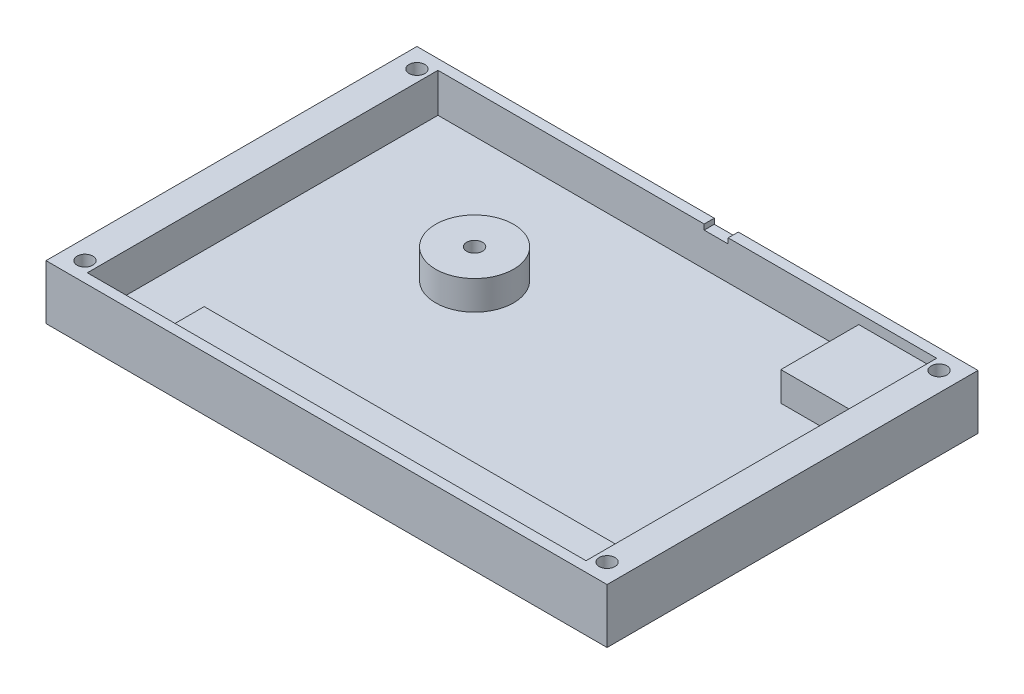
ISO-10303-21;
HEADER;
FILE_DESCRIPTION(('STEP AP214'),'2;1');
FILE_NAME('part.step','',(''),(''),'','','');
FILE_SCHEMA(('AUTOMOTIVE_DESIGN { 1 0 10303 214 1 1 1 1 }'));
ENDSEC;
DATA;
#1=APPLICATION_CONTEXT('core data for automotive mechanical design processes');
#2=APPLICATION_PROTOCOL_DEFINITION('international standard','automotive_design',2000,#1);
#3=PRODUCT_CONTEXT('',#1,'mechanical');
#4=PRODUCT('Part','Part','',(#3));
#5=PRODUCT_RELATED_PRODUCT_CATEGORY('part','',(#4));
#6=PRODUCT_DEFINITION_FORMATION('','',#4);
#7=PRODUCT_DEFINITION_CONTEXT('part definition',#1,'design');
#8=PRODUCT_DEFINITION('design','',#6,#7);
#9=PRODUCT_DEFINITION_SHAPE('','',#8);
#10=(LENGTH_UNIT() NAMED_UNIT(*) SI_UNIT(.MILLI.,.METRE.));
#11=(NAMED_UNIT(*) PLANE_ANGLE_UNIT() SI_UNIT($,.RADIAN.));
#12=(NAMED_UNIT(*) SI_UNIT($,.STERADIAN.) SOLID_ANGLE_UNIT());
#13=UNCERTAINTY_MEASURE_WITH_UNIT(LENGTH_MEASURE(1.E-05),#10,'distance_accuracy_value','');
#14=(GEOMETRIC_REPRESENTATION_CONTEXT(3) GLOBAL_UNCERTAINTY_ASSIGNED_CONTEXT((#13)) GLOBAL_UNIT_ASSIGNED_CONTEXT((#10,
#11,#12)) REPRESENTATION_CONTEXT('',''));
#15=CARTESIAN_POINT('',(0.,0.,0.));
#16=DIRECTION('',(0.,0.,1.));
#17=DIRECTION('',(1.,0.,0.));
#18=AXIS2_PLACEMENT_3D('',#15,#16,#17);
#19=CARTESIAN_POINT('',(0.,7.2898,0.));
#20=DIRECTION('',(0.,-1.,0.));
#21=DIRECTION('',(0.,0.,-1.));
#22=AXIS2_PLACEMENT_3D('',#19,#20,#21);
#23=PLANE('',#22);
#24=DIRECTION('',(1.,0.,0.));
#25=VECTOR('',#24,1.);
#26=CARTESIAN_POINT('',(0.,7.2898,22.225));
#27=LINE('',#26,#25);
#28=CARTESIAN_POINT('',(-27.94,7.2898,22.225));
#29=VERTEX_POINT('',#28);
#30=CARTESIAN_POINT('',(40.64,7.2898,22.225));
#31=VERTEX_POINT('',#30);
#32=EDGE_CURVE('E289',#29,#31,#27,.T.);
#33=ORIENTED_EDGE('',*,*,#32,.F.);
#34=DIRECTION('',(0.,0.,1.));
#35=VECTOR('',#34,1.);
#36=CARTESIAN_POINT('',(-27.94,7.2898,0.));
#37=LINE('',#36,#35);
#38=CARTESIAN_POINT('',(-27.94,7.2898,28.575));
#39=VERTEX_POINT('',#38);
#40=EDGE_CURVE('E281',#29,#39,#37,.T.);
#41=ORIENTED_EDGE('',*,*,#40,.T.);
#42=DIRECTION('',(1.,0.,0.));
#43=VECTOR('',#42,1.);
#44=CARTESIAN_POINT('',(40.64,7.2898,28.575));
#45=LINE('',#44,#43);
#46=CARTESIAN_POINT('',(40.64,7.2898,28.575));
#47=VERTEX_POINT('',#46);
#48=EDGE_CURVE('E321',#39,#47,#45,.T.);
#49=ORIENTED_EDGE('',*,*,#48,.T.);
#50=DIRECTION('',(0.,0.,-1.));
#51=VECTOR('',#50,1.);
#52=CARTESIAN_POINT('',(40.64,7.2898,-28.575));
#53=LINE('',#52,#51);
#54=EDGE_CURVE('E325',#47,#31,#53,.T.);
#55=ORIENTED_EDGE('',*,*,#54,.T.);
#56=EDGE_LOOP('',(#33,#41,#49,#55));
#57=FACE_BOUND('',#56,.T.);
#58=ADVANCED_FACE('F62',(#57),#23,.F.);
#59=CARTESIAN_POINT('',(-45.72,8.89,-30.226));
#60=DIRECTION('',(1.,0.,0.));
#61=DIRECTION('',(0.,0.,-1.));
#62=AXIS2_PLACEMENT_3D('',#59,#60,#61);
#63=PLANE('',#62);
#64=DIRECTION('',(0.,0.,1.));
#65=VECTOR('',#64,1.);
#66=CARTESIAN_POINT('',(-45.72,0.,-30.226));
#67=LINE('',#66,#65);
#68=CARTESIAN_POINT('',(-45.72,0.,-30.226));
#69=VERTEX_POINT('',#68);
#70=CARTESIAN_POINT('',(-45.72,0.,30.226));
#71=VERTEX_POINT('',#70);
#72=EDGE_CURVE('E347',#69,#71,#67,.T.);
#73=ORIENTED_EDGE('',*,*,#72,.T.);
#74=DIRECTION('',(0.,-1.,0.));
#75=VECTOR('',#74,1.);
#76=CARTESIAN_POINT('',(-45.72,8.89,30.226));
#77=LINE('',#76,#75);
#78=CARTESIAN_POINT('',(-45.72,8.89,30.226));
#79=VERTEX_POINT('',#78);
#80=EDGE_CURVE('E13',#79,#71,#77,.T.);
#81=ORIENTED_EDGE('',*,*,#80,.F.);
#82=DIRECTION('',(0.,0.,1.));
#83=VECTOR('',#82,1.);
#84=CARTESIAN_POINT('',(-45.72,8.89,-30.226));
#85=LINE('',#84,#83);
#86=CARTESIAN_POINT('',(-45.72,8.89,-30.226));
#87=VERTEX_POINT('',#86);
#88=EDGE_CURVE('E354',#87,#79,#85,.T.);
#89=ORIENTED_EDGE('',*,*,#88,.F.);
#90=DIRECTION('',(0.,-1.,0.));
#91=VECTOR('',#90,1.);
#92=CARTESIAN_POINT('',(-45.72,8.89,-30.226));
#93=LINE('',#92,#91);
#94=EDGE_CURVE('E366',#87,#69,#93,.T.);
#95=ORIENTED_EDGE('',*,*,#94,.T.);
#96=EDGE_LOOP('',(#73,#81,#89,#95));
#97=FACE_BOUND('',#96,.T.);
#98=ADVANCED_FACE('F64',(#97),#63,.F.);
#99=CARTESIAN_POINT('',(45.72,8.89,30.226));
#100=DIRECTION('',(0.,0.,-1.));
#101=DIRECTION('',(-1.,0.,0.));
#102=AXIS2_PLACEMENT_3D('',#99,#100,#101);
#103=PLANE('',#102);
#104=DIRECTION('',(1.,0.,0.));
#105=VECTOR('',#104,1.);
#106=CARTESIAN_POINT('',(45.72,0.,30.226));
#107=LINE('',#106,#105);
#108=CARTESIAN_POINT('',(45.72,0.,30.226));
#109=VERTEX_POINT('',#108);
#110=EDGE_CURVE('E369',#71,#109,#107,.T.);
#111=ORIENTED_EDGE('',*,*,#110,.T.);
#112=DIRECTION('',(0.,-1.,0.));
#113=VECTOR('',#112,1.);
#114=CARTESIAN_POINT('',(45.72,8.89,30.226));
#115=LINE('',#114,#113);
#116=CARTESIAN_POINT('',(45.72,8.89,30.226));
#117=VERTEX_POINT('',#116);
#118=EDGE_CURVE('E72',#117,#109,#115,.T.);
#119=ORIENTED_EDGE('',*,*,#118,.F.);
#120=DIRECTION('',(1.,0.,0.));
#121=VECTOR('',#120,1.);
#122=CARTESIAN_POINT('',(45.72,8.89,30.226));
#123=LINE('',#122,#121);
#124=EDGE_CURVE('E357',#79,#117,#123,.T.);
#125=ORIENTED_EDGE('',*,*,#124,.F.);
#126=ORIENTED_EDGE('',*,*,#80,.T.);
#127=EDGE_LOOP('',(#111,#119,#125,#126));
#128=FACE_BOUND('',#127,.T.);
#129=ADVANCED_FACE('F462',(#128),#103,.F.);
#130=CARTESIAN_POINT('',(45.72,8.89,-30.226));
#131=DIRECTION('',(-1.,0.,0.));
#132=DIRECTION('',(0.,0.,1.));
#133=AXIS2_PLACEMENT_3D('',#130,#131,#132);
#134=PLANE('',#133);
#135=DIRECTION('',(0.,0.,-1.));
#136=VECTOR('',#135,1.);
#137=CARTESIAN_POINT('',(45.72,0.,-30.226));
#138=LINE('',#137,#136);
#139=CARTESIAN_POINT('',(45.72,0.,-30.226));
#140=VERTEX_POINT('',#139);
#141=EDGE_CURVE('E371',#109,#140,#138,.T.);
#142=ORIENTED_EDGE('',*,*,#141,.T.);
#143=DIRECTION('',(0.,-1.,0.));
#144=VECTOR('',#143,1.);
#145=CARTESIAN_POINT('',(45.72,8.89,-30.226));
#146=LINE('',#145,#144);
#147=CARTESIAN_POINT('',(45.72,8.89,-30.226));
#148=VERTEX_POINT('',#147);
#149=EDGE_CURVE('E376',#148,#140,#146,.T.);
#150=ORIENTED_EDGE('',*,*,#149,.F.);
#151=DIRECTION('',(0.,0.,-1.));
#152=VECTOR('',#151,1.);
#153=CARTESIAN_POINT('',(45.72,8.89,-30.226));
#154=LINE('',#153,#152);
#155=EDGE_CURVE('E360',#117,#148,#154,.T.);
#156=ORIENTED_EDGE('',*,*,#155,.F.);
#157=ORIENTED_EDGE('',*,*,#118,.T.);
#158=EDGE_LOOP('',(#142,#150,#156,#157));
#159=FACE_BOUND('',#158,.T.);
#160=ADVANCED_FACE('F383',(#159),#134,.F.);
#161=CARTESIAN_POINT('',(45.72,8.89,-30.226));
#162=DIRECTION('',(0.,0.,1.));
#163=DIRECTION('',(1.,0.,0.));
#164=AXIS2_PLACEMENT_3D('',#161,#162,#163);
#165=PLANE('',#164);
#166=DIRECTION('',(-1.,0.,0.));
#167=VECTOR('',#166,1.);
#168=CARTESIAN_POINT('',(2.74320000000001,8.0264,-30.226));
#169=LINE('',#168,#167);
#170=CARTESIAN_POINT('',(6.65480000000001,8.0264,-30.226));
#171=VERTEX_POINT('',#170);
#172=CARTESIAN_POINT('',(2.74320000000001,8.0264,-30.226));
#173=VERTEX_POINT('',#172);
#174=EDGE_CURVE('E215',#171,#173,#169,.T.);
#175=ORIENTED_EDGE('',*,*,#174,.F.);
#176=DIRECTION('',(0.,-1.,0.));
#177=VECTOR('',#176,1.);
#178=CARTESIAN_POINT('',(6.65480000000001,8.0264,-30.226));
#179=LINE('',#178,#177);
#180=CARTESIAN_POINT('',(6.65480000000001,8.89,-30.226));
#181=VERTEX_POINT('',#180);
#182=EDGE_CURVE('E196',#181,#171,#179,.T.);
#183=ORIENTED_EDGE('',*,*,#182,.F.);
#184=DIRECTION('',(-1.,0.,0.));
#185=VECTOR('',#184,1.);
#186=CARTESIAN_POINT('',(45.72,8.89,-30.226));
#187=LINE('',#186,#185);
#188=EDGE_CURVE('E363',#148,#181,#187,.T.);
#189=ORIENTED_EDGE('',*,*,#188,.F.);
#190=ORIENTED_EDGE('',*,*,#149,.T.);
#191=DIRECTION('',(-1.,0.,0.));
#192=VECTOR('',#191,1.);
#193=CARTESIAN_POINT('',(45.72,0.,-30.226));
#194=LINE('',#193,#192);
#195=EDGE_CURVE('E358',#140,#69,#194,.T.);
#196=ORIENTED_EDGE('',*,*,#195,.T.);
#197=ORIENTED_EDGE('',*,*,#94,.F.);
#198=CARTESIAN_POINT('',(2.74320000000001,8.89,-30.226));
#199=VERTEX_POINT('',#198);
#200=EDGE_CURVE('E362',#199,#87,#187,.T.);
#201=ORIENTED_EDGE('',*,*,#200,.F.);
#202=DIRECTION('',(0.,1.,0.));
#203=VECTOR('',#202,1.);
#204=CARTESIAN_POINT('',(2.74320000000001,8.0264,-30.226));
#205=LINE('',#204,#203);
#206=EDGE_CURVE('E201',#173,#199,#205,.T.);
#207=ORIENTED_EDGE('',*,*,#206,.F.);
#208=EDGE_LOOP('',(#175,#183,#189,#190,#196,#197,#201,#207));
#209=FACE_BOUND('',#208,.T.);
#210=ADVANCED_FACE('F392',(#209),#165,.F.);
#211=CARTESIAN_POINT('',(0.,8.89,0.));
#212=DIRECTION('',(0.,-1.,0.));
#213=DIRECTION('',(0.,0.,-1.));
#214=AXIS2_PLACEMENT_3D('',#211,#212,#213);
#215=PLANE('',#214);
#216=CARTESIAN_POINT('',(42.545,8.89,-27.051));
#217=DIRECTION('',(0.,1.,0.));
#218=DIRECTION('',(0.,0.,1.));
#219=AXIS2_PLACEMENT_3D('',#216,#217,#218);
#220=CIRCLE('',#219,1.28905);
#221=CARTESIAN_POINT('',(42.545,8.89,-25.76195));
#222=VERTEX_POINT('',#221);
#223=EDGE_CURVE('E207',#222,#222,#220,.T.);
#224=ORIENTED_EDGE('',*,*,#223,.F.);
#225=EDGE_LOOP('',(#224));
#226=FACE_BOUND('',#225,.T.);
#227=CARTESIAN_POINT('',(42.545,8.89,27.051));
#228=DIRECTION('',(0.,1.,0.));
#229=DIRECTION('',(0.,0.,1.));
#230=AXIS2_PLACEMENT_3D('',#227,#228,#229);
#231=CIRCLE('',#230,1.28905);
#232=CARTESIAN_POINT('',(42.545,8.89,28.34005));
#233=VERTEX_POINT('',#232);
#234=EDGE_CURVE('E229',#233,#233,#231,.T.);
#235=ORIENTED_EDGE('',*,*,#234,.F.);
#236=EDGE_LOOP('',(#235));
#237=FACE_BOUND('',#236,.T.);
#238=CARTESIAN_POINT('',(-42.545,8.89,27.051));
#239=DIRECTION('',(0.,1.,0.));
#240=DIRECTION('',(0.,0.,1.));
#241=AXIS2_PLACEMENT_3D('',#238,#239,#240);
#242=CIRCLE('',#241,1.28905);
#243=CARTESIAN_POINT('',(-42.545,8.89,28.34005));
#244=VERTEX_POINT('',#243);
#245=EDGE_CURVE('E235',#244,#244,#242,.T.);
#246=ORIENTED_EDGE('',*,*,#245,.F.);
#247=EDGE_LOOP('',(#246));
#248=FACE_BOUND('',#247,.T.);
#249=CARTESIAN_POINT('',(-42.545,8.89,-27.051));
#250=DIRECTION('',(0.,1.,0.));
#251=DIRECTION('',(0.,0.,1.));
#252=AXIS2_PLACEMENT_3D('',#249,#250,#251);
#253=CIRCLE('',#252,1.28905);
#254=CARTESIAN_POINT('',(-42.545,8.89,-25.76195));
#255=VERTEX_POINT('',#254);
#256=EDGE_CURVE('E241',#255,#255,#253,.T.);
#257=ORIENTED_EDGE('',*,*,#256,.F.);
#258=EDGE_LOOP('',(#257));
#259=FACE_BOUND('',#258,.T.);
#260=ORIENTED_EDGE('',*,*,#188,.T.);
#261=DIRECTION('',(0.,0.,-1.));
#262=VECTOR('',#261,1.);
#263=CARTESIAN_POINT('',(6.65480000000002,8.89,30.227));
#264=LINE('',#263,#262);
#265=CARTESIAN_POINT('',(6.65480000000001,8.89,-28.575));
#266=VERTEX_POINT('',#265);
#267=EDGE_CURVE('E208',#266,#181,#264,.T.);
#268=ORIENTED_EDGE('',*,*,#267,.F.);
#269=DIRECTION('',(-1.,0.,0.));
#270=VECTOR('',#269,1.);
#271=CARTESIAN_POINT('',(40.64,8.89,-28.575));
#272=LINE('',#271,#270);
#273=CARTESIAN_POINT('',(40.64,8.89,-28.575));
#274=VERTEX_POINT('',#273);
#275=EDGE_CURVE('E213',#274,#266,#272,.T.);
#276=ORIENTED_EDGE('',*,*,#275,.F.);
#277=DIRECTION('',(0.,0.,-1.));
#278=VECTOR('',#277,1.);
#279=CARTESIAN_POINT('',(40.64,8.89,-28.575));
#280=LINE('',#279,#278);
#281=CARTESIAN_POINT('',(40.64,8.89,28.575));
#282=VERTEX_POINT('',#281);
#283=EDGE_CURVE('E339',#282,#274,#280,.T.);
#284=ORIENTED_EDGE('',*,*,#283,.F.);
#285=DIRECTION('',(1.,0.,0.));
#286=VECTOR('',#285,1.);
#287=CARTESIAN_POINT('',(40.64,8.89,28.575));
#288=LINE('',#287,#286);
#289=CARTESIAN_POINT('',(-40.64,8.89,28.575));
#290=VERTEX_POINT('',#289);
#291=EDGE_CURVE('E336',#290,#282,#288,.T.);
#292=ORIENTED_EDGE('',*,*,#291,.F.);
#293=DIRECTION('',(0.,0.,1.));
#294=VECTOR('',#293,1.);
#295=CARTESIAN_POINT('',(-40.64,8.89,-28.575));
#296=LINE('',#295,#294);
#297=CARTESIAN_POINT('',(-40.64,8.89,-28.575));
#298=VERTEX_POINT('',#297);
#299=EDGE_CURVE('E277',#298,#290,#296,.T.);
#300=ORIENTED_EDGE('',*,*,#299,.F.);
#301=CARTESIAN_POINT('',(2.74320000000001,8.89,-28.575));
#302=VERTEX_POINT('',#301);
#303=EDGE_CURVE('E342',#302,#298,#272,.T.);
#304=ORIENTED_EDGE('',*,*,#303,.F.);
#305=DIRECTION('',(0.,0.,-1.));
#306=VECTOR('',#305,1.);
#307=CARTESIAN_POINT('',(2.74320000000002,8.89,30.227));
#308=LINE('',#307,#306);
#309=EDGE_CURVE('E222',#302,#199,#308,.T.);
#310=ORIENTED_EDGE('',*,*,#309,.T.);
#311=ORIENTED_EDGE('',*,*,#200,.T.);
#312=ORIENTED_EDGE('',*,*,#88,.T.);
#313=ORIENTED_EDGE('',*,*,#124,.T.);
#314=ORIENTED_EDGE('',*,*,#155,.T.);
#315=EDGE_LOOP('',(#260,#268,#276,#284,#292,#300,#304,#310,#311,#312,#313,#314));
#316=FACE_BOUND('',#315,.T.);
#317=ADVANCED_FACE('F399',(#226,#237,#248,#259,#316),#215,.F.);
#318=CARTESIAN_POINT('',(0.,0.,0.));
#319=DIRECTION('',(0.,-1.,0.));
#320=DIRECTION('',(0.,0.,-1.));
#321=AXIS2_PLACEMENT_3D('',#318,#319,#320);
#322=PLANE('',#321);
#323=CARTESIAN_POINT('',(42.545,0.,-27.051));
#324=DIRECTION('',(0.,1.,0.));
#325=DIRECTION('',(0.,0.,1.));
#326=AXIS2_PLACEMENT_3D('',#323,#324,#325);
#327=CIRCLE('',#326,1.28905);
#328=CARTESIAN_POINT('',(42.545,0.,-25.76195));
#329=VERTEX_POINT('',#328);
#330=EDGE_CURVE('E226',#329,#329,#327,.T.);
#331=ORIENTED_EDGE('',*,*,#330,.T.);
#332=EDGE_LOOP('',(#331));
#333=FACE_BOUND('',#332,.T.);
#334=CARTESIAN_POINT('',(42.545,0.,27.051));
#335=DIRECTION('',(0.,1.,0.));
#336=DIRECTION('',(0.,0.,1.));
#337=AXIS2_PLACEMENT_3D('',#334,#335,#336);
#338=CIRCLE('',#337,1.28905);
#339=CARTESIAN_POINT('',(42.545,0.,28.34005));
#340=VERTEX_POINT('',#339);
#341=EDGE_CURVE('E232',#340,#340,#338,.T.);
#342=ORIENTED_EDGE('',*,*,#341,.T.);
#343=EDGE_LOOP('',(#342));
#344=FACE_BOUND('',#343,.T.);
#345=CARTESIAN_POINT('',(-42.545,0.,27.051));
#346=DIRECTION('',(0.,1.,0.));
#347=DIRECTION('',(0.,0.,1.));
#348=AXIS2_PLACEMENT_3D('',#345,#346,#347);
#349=CIRCLE('',#348,1.28905);
#350=CARTESIAN_POINT('',(-42.545,0.,28.34005));
#351=VERTEX_POINT('',#350);
#352=EDGE_CURVE('E238',#351,#351,#349,.T.);
#353=ORIENTED_EDGE('',*,*,#352,.T.);
#354=EDGE_LOOP('',(#353));
#355=FACE_BOUND('',#354,.T.);
#356=CARTESIAN_POINT('',(-42.545,0.,-27.051));
#357=DIRECTION('',(0.,1.,0.));
#358=DIRECTION('',(0.,0.,1.));
#359=AXIS2_PLACEMENT_3D('',#356,#357,#358);
#360=CIRCLE('',#359,1.28905);
#361=CARTESIAN_POINT('',(-42.545,0.,-25.76195));
#362=VERTEX_POINT('',#361);
#363=EDGE_CURVE('E244',#362,#362,#360,.T.);
#364=ORIENTED_EDGE('',*,*,#363,.T.);
#365=EDGE_LOOP('',(#364));
#366=FACE_BOUND('',#365,.T.);
#367=ORIENTED_EDGE('',*,*,#72,.F.);
#368=ORIENTED_EDGE('',*,*,#195,.F.);
#369=ORIENTED_EDGE('',*,*,#141,.F.);
#370=ORIENTED_EDGE('',*,*,#110,.F.);
#371=EDGE_LOOP('',(#367,#368,#369,#370));
#372=FACE_BOUND('',#371,.T.);
#373=ADVANCED_FACE('F389',(#333,#344,#355,#366,#372),#322,.T.);
#374=CARTESIAN_POINT('',(-40.64,7.2898,-28.575));
#375=DIRECTION('',(-1.,0.,0.));
#376=DIRECTION('',(0.,0.,1.));
#377=AXIS2_PLACEMENT_3D('',#374,#375,#376);
#378=PLANE('',#377);
#379=ORIENTED_EDGE('',*,*,#299,.T.);
#380=DIRECTION('',(0.,1.,0.));
#381=VECTOR('',#380,1.);
#382=CARTESIAN_POINT('',(-40.64,7.2898,28.575));
#383=LINE('',#382,#381);
#384=CARTESIAN_POINT('',(-40.64,2.54,28.575));
#385=VERTEX_POINT('',#384);
#386=EDGE_CURVE('E331',#385,#290,#383,.T.);
#387=ORIENTED_EDGE('',*,*,#386,.F.);
#388=DIRECTION('',(0.,0.,1.));
#389=VECTOR('',#388,1.);
#390=CARTESIAN_POINT('',(-40.64,2.54,0.));
#391=LINE('',#390,#389);
#392=CARTESIAN_POINT('',(-40.64,2.54,-28.575));
#393=VERTEX_POINT('',#392);
#394=EDGE_CURVE('E265',#393,#385,#391,.T.);
#395=ORIENTED_EDGE('',*,*,#394,.F.);
#396=DIRECTION('',(0.,1.,0.));
#397=VECTOR('',#396,1.);
#398=CARTESIAN_POINT('',(-40.64,7.2898,-28.575));
#399=LINE('',#398,#397);
#400=EDGE_CURVE('E344',#393,#298,#399,.T.);
#401=ORIENTED_EDGE('',*,*,#400,.T.);
#402=EDGE_LOOP('',(#379,#387,#395,#401));
#403=FACE_BOUND('',#402,.T.);
#404=ADVANCED_FACE('F407',(#403),#378,.F.);
#405=CARTESIAN_POINT('',(40.64,7.2898,-28.575));
#406=DIRECTION('',(0.,0.,-1.));
#407=DIRECTION('',(-1.,0.,0.));
#408=AXIS2_PLACEMENT_3D('',#405,#406,#407);
#409=PLANE('',#408);
#410=ORIENTED_EDGE('',*,*,#275,.T.);
#411=DIRECTION('',(0.,1.,0.));
#412=VECTOR('',#411,1.);
#413=CARTESIAN_POINT('',(6.65480000000001,8.0264,-28.575));
#414=LINE('',#413,#412);
#415=CARTESIAN_POINT('',(6.65480000000002,8.0264,-28.575));
#416=VERTEX_POINT('',#415);
#417=EDGE_CURVE('E193',#416,#266,#414,.T.);
#418=ORIENTED_EDGE('',*,*,#417,.F.);
#419=DIRECTION('',(1.,0.,0.));
#420=VECTOR('',#419,1.);
#421=CARTESIAN_POINT('',(2.74320000000002,8.0264,-28.575));
#422=LINE('',#421,#420);
#423=CARTESIAN_POINT('',(2.74320000000001,8.0264,-28.575));
#424=VERTEX_POINT('',#423);
#425=EDGE_CURVE('E204',#424,#416,#422,.T.);
#426=ORIENTED_EDGE('',*,*,#425,.F.);
#427=DIRECTION('',(0.,-1.,0.));
#428=VECTOR('',#427,1.);
#429=CARTESIAN_POINT('',(2.74320000000001,8.0264,-28.575));
#430=LINE('',#429,#428);
#431=EDGE_CURVE('E80',#302,#424,#430,.T.);
#432=ORIENTED_EDGE('',*,*,#431,.F.);
#433=ORIENTED_EDGE('',*,*,#303,.T.);
#434=ORIENTED_EDGE('',*,*,#400,.F.);
#435=DIRECTION('',(-1.,0.,0.));
#436=VECTOR('',#435,1.);
#437=CARTESIAN_POINT('',(0.,2.54,-28.575));
#438=LINE('',#437,#436);
#439=CARTESIAN_POINT('',(27.94,2.54,-28.575));
#440=VERTEX_POINT('',#439);
#441=EDGE_CURVE('E262',#440,#393,#438,.T.);
#442=ORIENTED_EDGE('',*,*,#441,.F.);
#443=DIRECTION('',(0.,1.,0.));
#444=VECTOR('',#443,1.);
#445=CARTESIAN_POINT('',(27.94,-99.3607613698687,-28.575));
#446=LINE('',#445,#444);
#447=CARTESIAN_POINT('',(27.94,7.2898,-28.575));
#448=VERTEX_POINT('',#447);
#449=EDGE_CURVE('E305',#440,#448,#446,.T.);
#450=ORIENTED_EDGE('',*,*,#449,.T.);
#451=DIRECTION('',(-1.,0.,0.));
#452=VECTOR('',#451,1.);
#453=CARTESIAN_POINT('',(40.64,7.2898,-28.575));
#454=LINE('',#453,#452);
#455=CARTESIAN_POINT('',(40.64,7.2898,-28.575));
#456=VERTEX_POINT('',#455);
#457=EDGE_CURVE('E328',#456,#448,#454,.T.);
#458=ORIENTED_EDGE('',*,*,#457,.F.);
#459=DIRECTION('',(0.,1.,0.));
#460=VECTOR('',#459,1.);
#461=CARTESIAN_POINT('',(40.64,7.2898,-28.575));
#462=LINE('',#461,#460);
#463=EDGE_CURVE('E348',#456,#274,#462,.T.);
#464=ORIENTED_EDGE('',*,*,#463,.T.);
#465=EDGE_LOOP('',(#410,#418,#426,#432,#433,#434,#442,#450,#458,#464));
#466=FACE_BOUND('',#465,.T.);
#467=ADVANCED_FACE('F211',(#466),#409,.F.);
#468=CARTESIAN_POINT('',(40.64,7.2898,-28.575));
#469=DIRECTION('',(1.,0.,0.));
#470=DIRECTION('',(0.,0.,-1.));
#471=AXIS2_PLACEMENT_3D('',#468,#469,#470);
#472=PLANE('',#471);
#473=ORIENTED_EDGE('',*,*,#283,.T.);
#474=ORIENTED_EDGE('',*,*,#463,.F.);
#475=CARTESIAN_POINT('',(40.64,7.2898,-15.875));
#476=VERTEX_POINT('',#475);
#477=EDGE_CURVE('E323',#476,#456,#53,.T.);
#478=ORIENTED_EDGE('',*,*,#477,.F.);
#479=DIRECTION('',(0.,1.,0.));
#480=VECTOR('',#479,1.);
#481=CARTESIAN_POINT('',(40.64,-99.3607613698687,-15.875));
#482=LINE('',#481,#480);
#483=CARTESIAN_POINT('',(40.64,2.54,-15.875));
#484=VERTEX_POINT('',#483);
#485=EDGE_CURVE('E294',#484,#476,#482,.T.);
#486=ORIENTED_EDGE('',*,*,#485,.F.);
#487=DIRECTION('',(0.,0.,-1.));
#488=VECTOR('',#487,1.);
#489=CARTESIAN_POINT('',(40.64,2.54,0.));
#490=LINE('',#489,#488);
#491=CARTESIAN_POINT('',(40.64,2.54,22.225));
#492=VERTEX_POINT('',#491);
#493=EDGE_CURVE('E255',#492,#484,#490,.T.);
#494=ORIENTED_EDGE('',*,*,#493,.F.);
#495=DIRECTION('',(0.,1.,0.));
#496=VECTOR('',#495,1.);
#497=CARTESIAN_POINT('',(40.64,-99.3607613698687,22.225));
#498=LINE('',#497,#496);
#499=EDGE_CURVE('E292',#492,#31,#498,.T.);
#500=ORIENTED_EDGE('',*,*,#499,.T.);
#501=ORIENTED_EDGE('',*,*,#54,.F.);
#502=DIRECTION('',(0.,1.,0.));
#503=VECTOR('',#502,1.);
#504=CARTESIAN_POINT('',(40.64,7.2898,28.575));
#505=LINE('',#504,#503);
#506=EDGE_CURVE('E350',#47,#282,#505,.T.);
#507=ORIENTED_EDGE('',*,*,#506,.T.);
#508=EDGE_LOOP('',(#473,#474,#478,#486,#494,#500,#501,#507));
#509=FACE_BOUND('',#508,.T.);
#510=ADVANCED_FACE('F430',(#509),#472,.F.);
#511=CARTESIAN_POINT('',(40.64,7.2898,28.575));
#512=DIRECTION('',(0.,0.,1.));
#513=DIRECTION('',(1.,0.,0.));
#514=AXIS2_PLACEMENT_3D('',#511,#512,#513);
#515=PLANE('',#514);
#516=ORIENTED_EDGE('',*,*,#291,.T.);
#517=ORIENTED_EDGE('',*,*,#506,.F.);
#518=ORIENTED_EDGE('',*,*,#48,.F.);
#519=DIRECTION('',(0.,1.,0.));
#520=VECTOR('',#519,1.);
#521=CARTESIAN_POINT('',(-27.94,-99.3607613698687,28.575));
#522=LINE('',#521,#520);
#523=CARTESIAN_POINT('',(-27.94,2.54,28.575));
#524=VERTEX_POINT('',#523);
#525=EDGE_CURVE('E309',#524,#39,#522,.T.);
#526=ORIENTED_EDGE('',*,*,#525,.F.);
#527=DIRECTION('',(1.,0.,0.));
#528=VECTOR('',#527,1.);
#529=CARTESIAN_POINT('',(0.,2.54,28.575));
#530=LINE('',#529,#528);
#531=EDGE_CURVE('E268',#385,#524,#530,.T.);
#532=ORIENTED_EDGE('',*,*,#531,.F.);
#533=ORIENTED_EDGE('',*,*,#386,.T.);
#534=EDGE_LOOP('',(#516,#517,#518,#526,#532,#533));
#535=FACE_BOUND('',#534,.T.);
#536=ADVANCED_FACE('F411',(#535),#515,.F.);
#537=DIRECTION('',(0.,0.,1.));
#538=VECTOR('',#537,1.);
#539=CARTESIAN_POINT('',(27.94,7.2898,0.));
#540=LINE('',#539,#538);
#541=CARTESIAN_POINT('',(27.94,7.2898,-15.875));
#542=VERTEX_POINT('',#541);
#543=EDGE_CURVE('E313',#448,#542,#540,.T.);
#544=ORIENTED_EDGE('',*,*,#543,.T.);
#545=DIRECTION('',(1.,0.,0.));
#546=VECTOR('',#545,1.);
#547=CARTESIAN_POINT('',(0.,7.2898,-15.875));
#548=LINE('',#547,#546);
#549=EDGE_CURVE('E66',#542,#476,#548,.T.);
#550=ORIENTED_EDGE('',*,*,#549,.T.);
#551=ORIENTED_EDGE('',*,*,#477,.T.);
#552=ORIENTED_EDGE('',*,*,#457,.T.);
#553=EDGE_LOOP('',(#544,#550,#551,#552));
#554=FACE_BOUND('',#553,.T.);
#555=ADVANCED_FACE('F426',(#554),#23,.F.);
#556=CARTESIAN_POINT('',(-14.351,-99.3607613698687,-8.25499999999997));
#557=DIRECTION('',(0.,1.,0.));
#558=DIRECTION('',(0.,0.,1.));
#559=AXIS2_PLACEMENT_3D('',#556,#557,#558);
#560=CYLINDRICAL_SURFACE('',#559,6.35);
#561=CARTESIAN_POINT('',(-14.351,7.2898,-8.25499999999997));
#562=DIRECTION('',(0.,1.,0.));
#563=DIRECTION('',(0.,0.,1.));
#564=AXIS2_PLACEMENT_3D('',#561,#562,#563);
#565=CIRCLE('',#564,6.35);
#566=CARTESIAN_POINT('',(-14.351,7.2898,-1.90499999999997));
#567=VERTEX_POINT('',#566);
#568=EDGE_CURVE('E273',#567,#567,#565,.T.);
#569=ORIENTED_EDGE('',*,*,#568,.F.);
#570=EDGE_LOOP('',(#569));
#571=FACE_BOUND('',#570,.T.);
#572=CARTESIAN_POINT('',(-14.351,2.54,-8.25499999999997));
#573=DIRECTION('',(0.,-1.,0.));
#574=DIRECTION('',(0.,0.,-1.));
#575=AXIS2_PLACEMENT_3D('',#572,#573,#574);
#576=CIRCLE('',#575,6.35);
#577=CARTESIAN_POINT('',(-14.351,2.54,-14.605));
#578=VERTEX_POINT('',#577);
#579=EDGE_CURVE('E274',#578,#578,#576,.F.);
#580=ORIENTED_EDGE('',*,*,#579,.T.);
#581=EDGE_LOOP('',(#580));
#582=FACE_BOUND('',#581,.T.);
#583=ADVANCED_FACE('F446',(#571,#582),#560,.T.);
#584=CARTESIAN_POINT('',(0.,-99.3607613698687,22.225));
#585=DIRECTION('',(0.,0.,1.));
#586=DIRECTION('',(1.,0.,0.));
#587=AXIS2_PLACEMENT_3D('',#584,#585,#586);
#588=PLANE('',#587);
#589=DIRECTION('',(0.,1.,0.));
#590=VECTOR('',#589,1.);
#591=CARTESIAN_POINT('',(-27.94,-99.3607613698687,22.225));
#592=LINE('',#591,#590);
#593=CARTESIAN_POINT('',(-27.94,2.54,22.225));
#594=VERTEX_POINT('',#593);
#595=EDGE_CURVE('E295',#594,#29,#592,.T.);
#596=ORIENTED_EDGE('',*,*,#595,.T.);
#597=ORIENTED_EDGE('',*,*,#32,.T.);
#598=ORIENTED_EDGE('',*,*,#499,.F.);
#599=DIRECTION('',(1.,0.,0.));
#600=VECTOR('',#599,1.);
#601=CARTESIAN_POINT('',(0.,2.54,22.225));
#602=LINE('',#601,#600);
#603=EDGE_CURVE('E278',#594,#492,#602,.T.);
#604=ORIENTED_EDGE('',*,*,#603,.F.);
#605=EDGE_LOOP('',(#596,#597,#598,#604));
#606=FACE_BOUND('',#605,.T.);
#607=ADVANCED_FACE('F443',(#606),#588,.F.);
#608=CARTESIAN_POINT('',(0.,-99.3607613698687,-15.875));
#609=DIRECTION('',(0.,0.,1.));
#610=DIRECTION('',(1.,0.,0.));
#611=AXIS2_PLACEMENT_3D('',#608,#609,#610);
#612=PLANE('',#611);
#613=DIRECTION('',(1.,0.,0.));
#614=VECTOR('',#613,1.);
#615=CARTESIAN_POINT('',(0.,2.54,-15.875));
#616=LINE('',#615,#614);
#617=CARTESIAN_POINT('',(27.94,2.54,-15.875));
#618=VERTEX_POINT('',#617);
#619=EDGE_CURVE('E258',#618,#484,#616,.T.);
#620=ORIENTED_EDGE('',*,*,#619,.T.);
#621=ORIENTED_EDGE('',*,*,#485,.T.);
#622=ORIENTED_EDGE('',*,*,#549,.F.);
#623=DIRECTION('',(0.,1.,0.));
#624=VECTOR('',#623,1.);
#625=CARTESIAN_POINT('',(27.94,-99.3607613698687,-15.875));
#626=LINE('',#625,#624);
#627=EDGE_CURVE('E302',#618,#542,#626,.T.);
#628=ORIENTED_EDGE('',*,*,#627,.F.);
#629=EDGE_LOOP('',(#620,#621,#622,#628));
#630=FACE_BOUND('',#629,.T.);
#631=ADVANCED_FACE('F445',(#630),#612,.T.);
#632=CARTESIAN_POINT('',(27.94,-99.3607613698687,0.));
#633=DIRECTION('',(-1.,0.,0.));
#634=DIRECTION('',(0.,0.,1.));
#635=AXIS2_PLACEMENT_3D('',#632,#633,#634);
#636=PLANE('',#635);
#637=DIRECTION('',(0.,0.,1.));
#638=VECTOR('',#637,1.);
#639=CARTESIAN_POINT('',(27.94,2.54,0.));
#640=LINE('',#639,#638);
#641=EDGE_CURVE('E260',#440,#618,#640,.T.);
#642=ORIENTED_EDGE('',*,*,#641,.T.);
#643=ORIENTED_EDGE('',*,*,#627,.T.);
#644=ORIENTED_EDGE('',*,*,#543,.F.);
#645=ORIENTED_EDGE('',*,*,#449,.F.);
#646=EDGE_LOOP('',(#642,#643,#644,#645));
#647=FACE_BOUND('',#646,.T.);
#648=ADVANCED_FACE('F423',(#647),#636,.T.);
#649=CARTESIAN_POINT('',(-27.94,-99.3607613698687,0.));
#650=DIRECTION('',(-1.,0.,0.));
#651=DIRECTION('',(0.,0.,1.));
#652=AXIS2_PLACEMENT_3D('',#649,#650,#651);
#653=PLANE('',#652);
#654=DIRECTION('',(0.,0.,1.));
#655=VECTOR('',#654,1.);
#656=CARTESIAN_POINT('',(-27.94,2.54,0.));
#657=LINE('',#656,#655);
#658=EDGE_CURVE('E271',#594,#524,#657,.T.);
#659=ORIENTED_EDGE('',*,*,#658,.T.);
#660=ORIENTED_EDGE('',*,*,#525,.T.);
#661=ORIENTED_EDGE('',*,*,#40,.F.);
#662=ORIENTED_EDGE('',*,*,#595,.F.);
#663=EDGE_LOOP('',(#659,#660,#661,#662));
#664=FACE_BOUND('',#663,.T.);
#665=ADVANCED_FACE('F437',(#664),#653,.T.);
#666=CARTESIAN_POINT('',(0.,2.54,0.));
#667=DIRECTION('',(0.,-1.,0.));
#668=DIRECTION('',(0.,0.,-1.));
#669=AXIS2_PLACEMENT_3D('',#666,#667,#668);
#670=PLANE('',#669);
#671=ORIENTED_EDGE('',*,*,#603,.T.);
#672=ORIENTED_EDGE('',*,*,#493,.T.);
#673=ORIENTED_EDGE('',*,*,#619,.F.);
#674=ORIENTED_EDGE('',*,*,#641,.F.);
#675=ORIENTED_EDGE('',*,*,#441,.T.);
#676=ORIENTED_EDGE('',*,*,#394,.T.);
#677=ORIENTED_EDGE('',*,*,#531,.T.);
#678=ORIENTED_EDGE('',*,*,#658,.F.);
#679=EDGE_LOOP('',(#671,#672,#673,#674,#675,#676,#677,#678));
#680=FACE_BOUND('',#679,.T.);
#681=ORIENTED_EDGE('',*,*,#579,.F.);
#682=EDGE_LOOP('',(#681));
#683=FACE_BOUND('',#682,.T.);
#684=ADVANCED_FACE('F417',(#680,#683),#670,.F.);
#685=CARTESIAN_POINT('',(-14.351,7.2898,-8.25499999999997));
#686=DIRECTION('',(0.,1.,0.));
#687=DIRECTION('',(0.,0.,1.));
#688=AXIS2_PLACEMENT_3D('',#685,#686,#687);
#689=CIRCLE('',#688,1.28905);
#690=CARTESIAN_POINT('',(-14.351,7.2898,-6.96594999999997));
#691=VERTEX_POINT('',#690);
#692=EDGE_CURVE('E247',#691,#691,#689,.T.);
#693=ORIENTED_EDGE('',*,*,#692,.F.);
#694=EDGE_LOOP('',(#693));
#695=FACE_BOUND('',#694,.T.);
#696=ORIENTED_EDGE('',*,*,#568,.T.);
#697=EDGE_LOOP('',(#696));
#698=FACE_BOUND('',#697,.T.);
#699=ADVANCED_FACE('F458',(#695,#698),#23,.F.);
#700=CARTESIAN_POINT('',(0.,2.54,0.));
#701=DIRECTION('',(0.,-1.,0.));
#702=DIRECTION('',(0.,0.,-1.));
#703=AXIS2_PLACEMENT_3D('',#700,#701,#702);
#704=PLANE('',#703);
#705=CARTESIAN_POINT('',(-14.351,2.54,-8.25499999999997));
#706=DIRECTION('',(0.,-1.,0.));
#707=DIRECTION('',(0.,0.,-1.));
#708=AXIS2_PLACEMENT_3D('',#705,#706,#707);
#709=CIRCLE('',#708,1.28905);
#710=CARTESIAN_POINT('',(-14.351,2.54,-9.54404999999997));
#711=VERTEX_POINT('',#710);
#712=EDGE_CURVE('E252',#711,#711,#709,.F.);
#713=ORIENTED_EDGE('',*,*,#712,.T.);
#714=EDGE_LOOP('',(#713));
#715=FACE_BOUND('',#714,.T.);
#716=ADVANCED_FACE('F466',(#715),#704,.F.);
#717=CARTESIAN_POINT('',(-14.351,-99.3607613698687,-8.25499999999997));
#718=DIRECTION('',(0.,1.,0.));
#719=DIRECTION('',(0.,0.,1.));
#720=AXIS2_PLACEMENT_3D('',#717,#718,#719);
#721=CYLINDRICAL_SURFACE('',#720,1.28905);
#722=ORIENTED_EDGE('',*,*,#692,.T.);
#723=EDGE_LOOP('',(#722));
#724=FACE_BOUND('',#723,.T.);
#725=ORIENTED_EDGE('',*,*,#712,.F.);
#726=EDGE_LOOP('',(#725));
#727=FACE_BOUND('',#726,.T.);
#728=ADVANCED_FACE('F472',(#724,#727),#721,.F.);
#729=CARTESIAN_POINT('',(-42.545,0.,-27.051));
#730=DIRECTION('',(0.,1.,0.));
#731=DIRECTION('',(0.,0.,1.));
#732=AXIS2_PLACEMENT_3D('',#729,#730,#731);
#733=CYLINDRICAL_SURFACE('',#732,1.28905);
#734=ORIENTED_EDGE('',*,*,#363,.F.);
#735=EDGE_LOOP('',(#734));
#736=FACE_BOUND('',#735,.T.);
#737=ORIENTED_EDGE('',*,*,#256,.T.);
#738=EDGE_LOOP('',(#737));
#739=FACE_BOUND('',#738,.T.);
#740=ADVANCED_FACE('F484',(#736,#739),#733,.F.);
#741=CARTESIAN_POINT('',(-42.545,0.,27.051));
#742=DIRECTION('',(0.,1.,0.));
#743=DIRECTION('',(0.,0.,1.));
#744=AXIS2_PLACEMENT_3D('',#741,#742,#743);
#745=CYLINDRICAL_SURFACE('',#744,1.28905);
#746=ORIENTED_EDGE('',*,*,#352,.F.);
#747=EDGE_LOOP('',(#746));
#748=FACE_BOUND('',#747,.T.);
#749=ORIENTED_EDGE('',*,*,#245,.T.);
#750=EDGE_LOOP('',(#749));
#751=FACE_BOUND('',#750,.T.);
#752=ADVANCED_FACE('F490',(#748,#751),#745,.F.);
#753=CARTESIAN_POINT('',(42.545,0.,27.051));
#754=DIRECTION('',(0.,1.,0.));
#755=DIRECTION('',(0.,0.,1.));
#756=AXIS2_PLACEMENT_3D('',#753,#754,#755);
#757=CYLINDRICAL_SURFACE('',#756,1.28905);
#758=ORIENTED_EDGE('',*,*,#341,.F.);
#759=EDGE_LOOP('',(#758));
#760=FACE_BOUND('',#759,.T.);
#761=ORIENTED_EDGE('',*,*,#234,.T.);
#762=EDGE_LOOP('',(#761));
#763=FACE_BOUND('',#762,.T.);
#764=ADVANCED_FACE('F549',(#760,#763),#757,.F.);
#765=CARTESIAN_POINT('',(42.545,0.,-27.051));
#766=DIRECTION('',(0.,1.,0.));
#767=DIRECTION('',(0.,0.,1.));
#768=AXIS2_PLACEMENT_3D('',#765,#766,#767);
#769=CYLINDRICAL_SURFACE('',#768,1.28905);
#770=ORIENTED_EDGE('',*,*,#330,.F.);
#771=EDGE_LOOP('',(#770));
#772=FACE_BOUND('',#771,.T.);
#773=ORIENTED_EDGE('',*,*,#223,.T.);
#774=EDGE_LOOP('',(#773));
#775=FACE_BOUND('',#774,.T.);
#776=ADVANCED_FACE('F558',(#772,#775),#769,.F.);
#777=CARTESIAN_POINT('',(6.65480000000002,8.0264,30.227));
#778=DIRECTION('',(1.,0.,0.));
#779=DIRECTION('',(0.,0.,-1.));
#780=AXIS2_PLACEMENT_3D('',#777,#778,#779);
#781=PLANE('',#780);
#782=ORIENTED_EDGE('',*,*,#417,.T.);
#783=ORIENTED_EDGE('',*,*,#267,.T.);
#784=ORIENTED_EDGE('',*,*,#182,.T.);
#785=DIRECTION('',(0.,0.,-1.));
#786=VECTOR('',#785,1.);
#787=CARTESIAN_POINT('',(6.65480000000002,8.0264,30.227));
#788=LINE('',#787,#786);
#789=EDGE_CURVE('E189',#416,#171,#788,.T.);
#790=ORIENTED_EDGE('',*,*,#789,.F.);
#791=EDGE_LOOP('',(#782,#783,#784,#790));
#792=FACE_BOUND('',#791,.T.);
#793=ADVANCED_FACE('F191',(#792),#781,.F.);
#794=CARTESIAN_POINT('',(2.74320000000002,8.0264,30.227));
#795=DIRECTION('',(-1.,0.,0.));
#796=DIRECTION('',(0.,0.,1.));
#797=AXIS2_PLACEMENT_3D('',#794,#795,#796);
#798=PLANE('',#797);
#799=ORIENTED_EDGE('',*,*,#431,.T.);
#800=DIRECTION('',(0.,0.,-1.));
#801=VECTOR('',#800,1.);
#802=CARTESIAN_POINT('',(2.74320000000002,8.0264,30.227));
#803=LINE('',#802,#801);
#804=EDGE_CURVE('E200',#424,#173,#803,.T.);
#805=ORIENTED_EDGE('',*,*,#804,.T.);
#806=ORIENTED_EDGE('',*,*,#206,.T.);
#807=ORIENTED_EDGE('',*,*,#309,.F.);
#808=EDGE_LOOP('',(#799,#805,#806,#807));
#809=FACE_BOUND('',#808,.T.);
#810=ADVANCED_FACE('F402',(#809),#798,.F.);
#811=CARTESIAN_POINT('',(2.74320000000002,8.0264,30.227));
#812=DIRECTION('',(0.,-1.,0.));
#813=DIRECTION('',(0.,0.,-1.));
#814=AXIS2_PLACEMENT_3D('',#811,#812,#813);
#815=PLANE('',#814);
#816=ORIENTED_EDGE('',*,*,#425,.T.);
#817=ORIENTED_EDGE('',*,*,#789,.T.);
#818=ORIENTED_EDGE('',*,*,#174,.T.);
#819=ORIENTED_EDGE('',*,*,#804,.F.);
#820=EDGE_LOOP('',(#816,#817,#818,#819));
#821=FACE_BOUND('',#820,.T.);
#822=ADVANCED_FACE('F205',(#821),#815,.F.);
#823=CLOSED_SHELL('',(#58,#98,#129,#160,#210,#317,#373,#404,#467,#510,#536,#555,#583,#607,#631,
#648,#665,#684,#699,#716,#728,#740,#752,#764,#776,#793,#810,#822));
#824=MANIFOLD_SOLID_BREP('B2',#823);
#825=ADVANCED_BREP_SHAPE_REPRESENTATION('',(#18,#824),#14);
#826=SHAPE_DEFINITION_REPRESENTATION(#9,#825);
ENDSEC;
END-ISO-10303-21;
